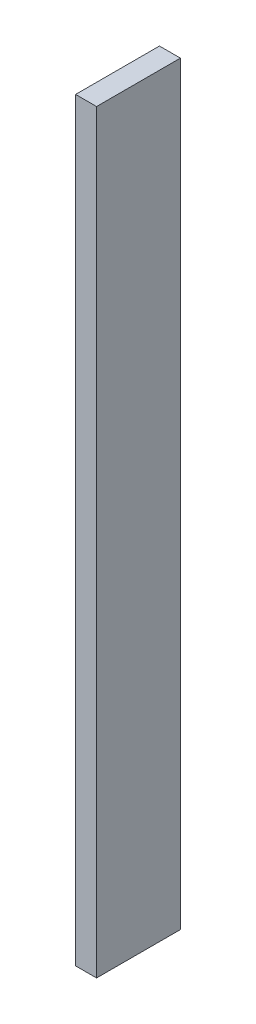
ISO-10303-21;
HEADER;
FILE_DESCRIPTION(('STEP AP214'),'2;1');
FILE_NAME('part.step','',(''),(''),'','','');
FILE_SCHEMA(('AUTOMOTIVE_DESIGN { 1 0 10303 214 1 1 1 1 }'));
ENDSEC;
DATA;
#1=APPLICATION_CONTEXT('core data for automotive mechanical design processes');
#2=APPLICATION_PROTOCOL_DEFINITION('international standard','automotive_design',2000,#1);
#3=PRODUCT_CONTEXT('',#1,'mechanical');
#4=PRODUCT('Part','Part','',(#3));
#5=PRODUCT_RELATED_PRODUCT_CATEGORY('part','',(#4));
#6=PRODUCT_DEFINITION_FORMATION('','',#4);
#7=PRODUCT_DEFINITION_CONTEXT('part definition',#1,'design');
#8=PRODUCT_DEFINITION('design','',#6,#7);
#9=PRODUCT_DEFINITION_SHAPE('','',#8);
#10=(LENGTH_UNIT() NAMED_UNIT(*) SI_UNIT(.MILLI.,.METRE.));
#11=(NAMED_UNIT(*) PLANE_ANGLE_UNIT() SI_UNIT($,.RADIAN.));
#12=(NAMED_UNIT(*) SI_UNIT($,.STERADIAN.) SOLID_ANGLE_UNIT());
#13=UNCERTAINTY_MEASURE_WITH_UNIT(LENGTH_MEASURE(1.E-05),#10,'distance_accuracy_value','');
#14=(GEOMETRIC_REPRESENTATION_CONTEXT(3) GLOBAL_UNCERTAINTY_ASSIGNED_CONTEXT((#13)) GLOBAL_UNIT_ASSIGNED_CONTEXT((#10,
#11,#12)) REPRESENTATION_CONTEXT('',''));
#15=CARTESIAN_POINT('',(0.,0.,0.));
#16=DIRECTION('',(0.,0.,1.));
#17=DIRECTION('',(1.,0.,0.));
#18=AXIS2_PLACEMENT_3D('',#15,#16,#17);
#19=CARTESIAN_POINT('',(0.,-457.2,0.));
#20=DIRECTION('',(-1.,0.,0.));
#21=DIRECTION('',(0.,0.,1.));
#22=AXIS2_PLACEMENT_3D('',#19,#20,#21);
#23=PLANE('',#22);
#24=DIRECTION('',(0.,0.,1.));
#25=VECTOR('',#24,1.);
#26=CARTESIAN_POINT('',(0.,0.,0.));
#27=LINE('',#26,#25);
#28=CARTESIAN_POINT('',(0.,0.,-50.8));
#29=VERTEX_POINT('',#28);
#30=CARTESIAN_POINT('',(0.,0.,0.));
#31=VERTEX_POINT('',#30);
#32=EDGE_CURVE('E109',#29,#31,#27,.T.);
#33=ORIENTED_EDGE('',*,*,#32,.F.);
#34=DIRECTION('',(0.,1.,0.));
#35=VECTOR('',#34,1.);
#36=CARTESIAN_POINT('',(0.,-457.2,-50.8));
#37=LINE('',#36,#35);
#38=CARTESIAN_POINT('',(0.,-457.2,-50.8));
#39=VERTEX_POINT('',#38);
#40=EDGE_CURVE('E11',#39,#29,#37,.T.);
#41=ORIENTED_EDGE('',*,*,#40,.F.);
#42=DIRECTION('',(0.,0.,1.));
#43=VECTOR('',#42,1.);
#44=CARTESIAN_POINT('',(0.,-457.2,0.));
#45=LINE('',#44,#43);
#46=CARTESIAN_POINT('',(0.,-457.2,0.));
#47=VERTEX_POINT('',#46);
#48=EDGE_CURVE('E101',#39,#47,#45,.T.);
#49=ORIENTED_EDGE('',*,*,#48,.T.);
#50=DIRECTION('',(0.,1.,0.));
#51=VECTOR('',#50,1.);
#52=CARTESIAN_POINT('',(0.,-457.2,0.));
#53=LINE('',#52,#51);
#54=EDGE_CURVE('E42',#47,#31,#53,.T.);
#55=ORIENTED_EDGE('',*,*,#54,.T.);
#56=EDGE_LOOP('',(#33,#41,#49,#55));
#57=FACE_BOUND('',#56,.T.);
#58=ADVANCED_FACE('F39',(#57),#23,.T.);
#59=CARTESIAN_POINT('',(0.,-457.2,-50.8));
#60=DIRECTION('',(0.,0.,-1.));
#61=DIRECTION('',(-1.,0.,0.));
#62=AXIS2_PLACEMENT_3D('',#59,#60,#61);
#63=PLANE('',#62);
#64=DIRECTION('',(-1.,0.,0.));
#65=VECTOR('',#64,1.);
#66=CARTESIAN_POINT('',(0.,0.,-50.8));
#67=LINE('',#66,#65);
#68=CARTESIAN_POINT('',(12.7,0.,-50.8));
#69=VERTEX_POINT('',#68);
#70=EDGE_CURVE('E104',#69,#29,#67,.T.);
#71=ORIENTED_EDGE('',*,*,#70,.F.);
#72=DIRECTION('',(0.,1.,0.));
#73=VECTOR('',#72,1.);
#74=CARTESIAN_POINT('',(12.7,-457.2,-50.8));
#75=LINE('',#74,#73);
#76=CARTESIAN_POINT('',(12.7,-457.2,-50.8));
#77=VERTEX_POINT('',#76);
#78=EDGE_CURVE('E49',#77,#69,#75,.T.);
#79=ORIENTED_EDGE('',*,*,#78,.F.);
#80=DIRECTION('',(-1.,0.,0.));
#81=VECTOR('',#80,1.);
#82=CARTESIAN_POINT('',(0.,-457.2,-50.8));
#83=LINE('',#82,#81);
#84=EDGE_CURVE('E96',#77,#39,#83,.T.);
#85=ORIENTED_EDGE('',*,*,#84,.T.);
#86=ORIENTED_EDGE('',*,*,#40,.T.);
#87=EDGE_LOOP('',(#71,#79,#85,#86));
#88=FACE_BOUND('',#87,.T.);
#89=ADVANCED_FACE('F125',(#88),#63,.T.);
#90=CARTESIAN_POINT('',(12.7,-457.2,0.));
#91=DIRECTION('',(1.,0.,0.));
#92=DIRECTION('',(0.,0.,-1.));
#93=AXIS2_PLACEMENT_3D('',#90,#91,#92);
#94=PLANE('',#93);
#95=DIRECTION('',(0.,0.,-1.));
#96=VECTOR('',#95,1.);
#97=CARTESIAN_POINT('',(12.7,0.,0.));
#98=LINE('',#97,#96);
#99=CARTESIAN_POINT('',(12.7,0.,0.));
#100=VERTEX_POINT('',#99);
#101=EDGE_CURVE('E90',#100,#69,#98,.T.);
#102=ORIENTED_EDGE('',*,*,#101,.F.);
#103=DIRECTION('',(0.,1.,0.));
#104=VECTOR('',#103,1.);
#105=CARTESIAN_POINT('',(12.7,-457.2,0.));
#106=LINE('',#105,#104);
#107=CARTESIAN_POINT('',(12.7,-457.2,0.));
#108=VERTEX_POINT('',#107);
#109=EDGE_CURVE('E85',#108,#100,#106,.T.);
#110=ORIENTED_EDGE('',*,*,#109,.F.);
#111=DIRECTION('',(0.,0.,-1.));
#112=VECTOR('',#111,1.);
#113=CARTESIAN_POINT('',(12.7,-457.2,0.));
#114=LINE('',#113,#112);
#115=EDGE_CURVE('E88',#108,#77,#114,.T.);
#116=ORIENTED_EDGE('',*,*,#115,.T.);
#117=ORIENTED_EDGE('',*,*,#78,.T.);
#118=EDGE_LOOP('',(#102,#110,#116,#117));
#119=FACE_BOUND('',#118,.T.);
#120=ADVANCED_FACE('F87',(#119),#94,.T.);
#121=CARTESIAN_POINT('',(0.,-457.2,0.));
#122=DIRECTION('',(0.,0.,1.));
#123=DIRECTION('',(1.,0.,0.));
#124=AXIS2_PLACEMENT_3D('',#121,#122,#123);
#125=PLANE('',#124);
#126=DIRECTION('',(1.,0.,0.));
#127=VECTOR('',#126,1.);
#128=CARTESIAN_POINT('',(0.,0.,0.));
#129=LINE('',#128,#127);
#130=EDGE_CURVE('E113',#31,#100,#129,.T.);
#131=ORIENTED_EDGE('',*,*,#130,.F.);
#132=ORIENTED_EDGE('',*,*,#54,.F.);
#133=DIRECTION('',(1.,0.,0.));
#134=VECTOR('',#133,1.);
#135=CARTESIAN_POINT('',(0.,-457.2,0.));
#136=LINE('',#135,#134);
#137=EDGE_CURVE('E95',#47,#108,#136,.T.);
#138=ORIENTED_EDGE('',*,*,#137,.T.);
#139=ORIENTED_EDGE('',*,*,#109,.T.);
#140=EDGE_LOOP('',(#131,#132,#138,#139));
#141=FACE_BOUND('',#140,.T.);
#142=ADVANCED_FACE('F99',(#141),#125,.T.);
#143=CARTESIAN_POINT('',(0.,-457.2,0.));
#144=DIRECTION('',(0.,-1.,0.));
#145=DIRECTION('',(0.,0.,-1.));
#146=AXIS2_PLACEMENT_3D('',#143,#144,#145);
#147=PLANE('',#146);
#148=ORIENTED_EDGE('',*,*,#48,.F.);
#149=ORIENTED_EDGE('',*,*,#84,.F.);
#150=ORIENTED_EDGE('',*,*,#115,.F.);
#151=ORIENTED_EDGE('',*,*,#137,.F.);
#152=EDGE_LOOP('',(#148,#149,#150,#151));
#153=FACE_BOUND('',#152,.T.);
#154=ADVANCED_FACE('F94',(#153),#147,.T.);
#155=CARTESIAN_POINT('',(0.,0.,0.));
#156=DIRECTION('',(0.,-1.,0.));
#157=DIRECTION('',(0.,0.,-1.));
#158=AXIS2_PLACEMENT_3D('',#155,#156,#157);
#159=PLANE('',#158);
#160=ORIENTED_EDGE('',*,*,#32,.T.);
#161=ORIENTED_EDGE('',*,*,#130,.T.);
#162=ORIENTED_EDGE('',*,*,#101,.T.);
#163=ORIENTED_EDGE('',*,*,#70,.T.);
#164=EDGE_LOOP('',(#160,#161,#162,#163));
#165=FACE_BOUND('',#164,.T.);
#166=ADVANCED_FACE('F124',(#165),#159,.F.);
#167=CLOSED_SHELL('',(#58,#89,#120,#142,#154,#166));
#168=MANIFOLD_SOLID_BREP('B2',#167);
#169=ADVANCED_BREP_SHAPE_REPRESENTATION('',(#18,#168),#14);
#170=SHAPE_DEFINITION_REPRESENTATION(#9,#169);
ENDSEC;
END-ISO-10303-21;
